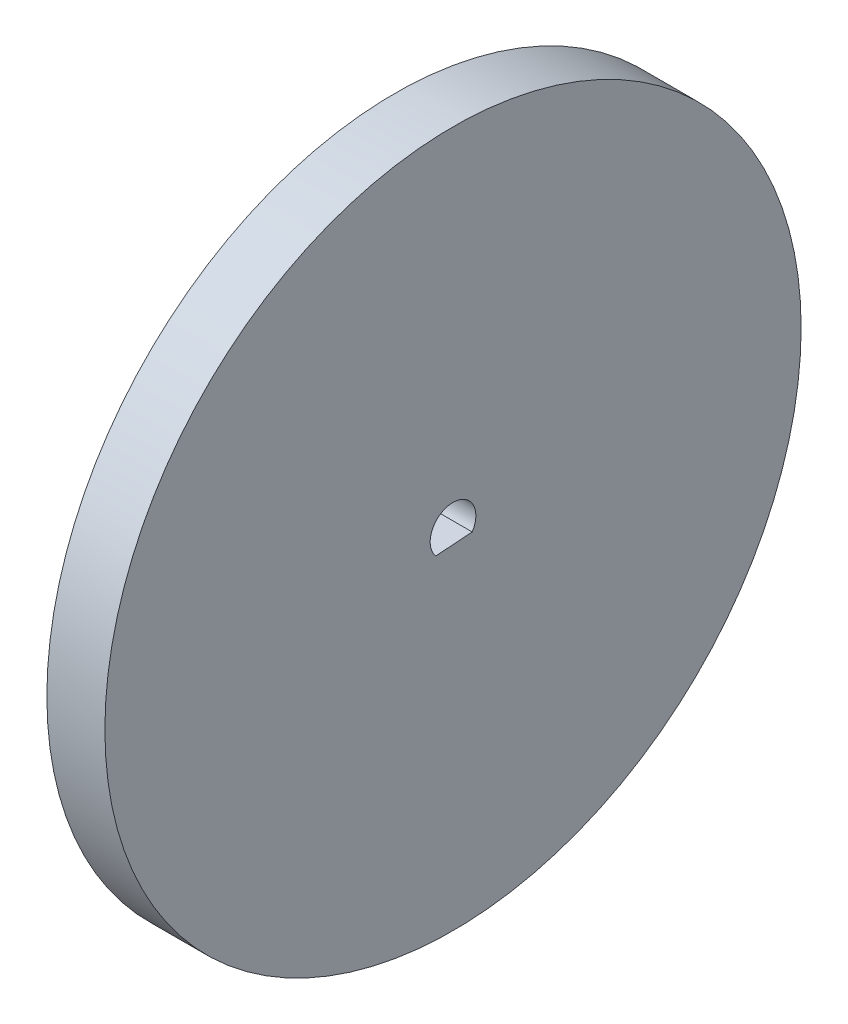
ISO-10303-21;
HEADER;
FILE_DESCRIPTION(('STEP AP214'),'2;1');
FILE_NAME('part.step','',(''),(''),'','','');
FILE_SCHEMA(('AUTOMOTIVE_DESIGN { 1 0 10303 214 1 1 1 1 }'));
ENDSEC;
DATA;
#1=APPLICATION_CONTEXT('core data for automotive mechanical design processes');
#2=APPLICATION_PROTOCOL_DEFINITION('international standard','automotive_design',2000,#1);
#3=PRODUCT_CONTEXT('',#1,'mechanical');
#4=PRODUCT('Part','Part','',(#3));
#5=PRODUCT_RELATED_PRODUCT_CATEGORY('part','',(#4));
#6=PRODUCT_DEFINITION_FORMATION('','',#4);
#7=PRODUCT_DEFINITION_CONTEXT('part definition',#1,'design');
#8=PRODUCT_DEFINITION('design','',#6,#7);
#9=PRODUCT_DEFINITION_SHAPE('','',#8);
#10=(LENGTH_UNIT() NAMED_UNIT(*) SI_UNIT(.MILLI.,.METRE.));
#11=(NAMED_UNIT(*) PLANE_ANGLE_UNIT() SI_UNIT($,.RADIAN.));
#12=(NAMED_UNIT(*) SI_UNIT($,.STERADIAN.) SOLID_ANGLE_UNIT());
#13=UNCERTAINTY_MEASURE_WITH_UNIT(LENGTH_MEASURE(1.E-05),#10,'distance_accuracy_value','');
#14=(GEOMETRIC_REPRESENTATION_CONTEXT(3) GLOBAL_UNCERTAINTY_ASSIGNED_CONTEXT((#13)) GLOBAL_UNIT_ASSIGNED_CONTEXT((#10,
#11,#12)) REPRESENTATION_CONTEXT('',''));
#15=CARTESIAN_POINT('',(0.,0.,0.));
#16=DIRECTION('',(0.,0.,1.));
#17=DIRECTION('',(1.,0.,0.));
#18=AXIS2_PLACEMENT_3D('',#15,#16,#17);
#19=CARTESIAN_POINT('',(6.35,0.,0.));
#20=DIRECTION('',(-1.,0.,0.));
#21=DIRECTION('',(0.,0.,1.));
#22=AXIS2_PLACEMENT_3D('',#19,#20,#21);
#23=CYLINDRICAL_SURFACE('',#22,38.1);
#24=CARTESIAN_POINT('',(6.35,0.,0.));
#25=DIRECTION('',(1.,0.,0.));
#26=DIRECTION('',(0.,0.,-1.));
#27=AXIS2_PLACEMENT_3D('',#24,#25,#26);
#28=CIRCLE('',#27,38.1);
#29=CARTESIAN_POINT('',(6.35,0.,-38.1));
#30=VERTEX_POINT('',#29);
#31=EDGE_CURVE('E13',#30,#30,#28,.T.);
#32=ORIENTED_EDGE('',*,*,#31,.F.);
#33=EDGE_LOOP('',(#32));
#34=FACE_BOUND('',#33,.T.);
#35=CARTESIAN_POINT('',(0.,0.,0.));
#36=DIRECTION('',(1.,0.,0.));
#37=DIRECTION('',(0.,0.,-1.));
#38=AXIS2_PLACEMENT_3D('',#35,#36,#37);
#39=CIRCLE('',#38,38.1);
#40=CARTESIAN_POINT('',(0.,0.,-38.1));
#41=VERTEX_POINT('',#40);
#42=EDGE_CURVE('E47',#41,#41,#39,.T.);
#43=ORIENTED_EDGE('',*,*,#42,.T.);
#44=EDGE_LOOP('',(#43));
#45=FACE_BOUND('',#44,.T.);
#46=ADVANCED_FACE('F44',(#34,#45),#23,.T.);
#47=CARTESIAN_POINT('',(6.35,0.,0.));
#48=DIRECTION('',(1.,0.,0.));
#49=DIRECTION('',(0.,0.,-1.));
#50=AXIS2_PLACEMENT_3D('',#47,#48,#49);
#51=PLANE('',#50);
#52=CARTESIAN_POINT('',(6.35,0.,0.));
#53=DIRECTION('',(1.,0.,0.));
#54=DIRECTION('',(0.,0.,-1.));
#55=AXIS2_PLACEMENT_3D('',#52,#53,#54);
#56=CIRCLE('',#55,2.5);
#57=CARTESIAN_POINT('',(6.35,-1.35532190021472,-2.10073857174055));
#58=VERTEX_POINT('',#57);
#59=CARTESIAN_POINT('',(6.35,-1.6372188968108,1.88931582429343));
#60=VERTEX_POINT('',#59);
#61=EDGE_CURVE('E58',#58,#60,#56,.T.);
#62=ORIENTED_EDGE('',*,*,#61,.F.);
#63=DIRECTION('',(0.,0.07047424914902,-0.997513599008496));
#64=VECTOR('',#63,1.);
#65=CARTESIAN_POINT('',(6.35,-1.6372188968108,1.88931582429343));
#66=LINE('',#65,#64);
#67=EDGE_CURVE('E77',#60,#58,#66,.T.);
#68=ORIENTED_EDGE('',*,*,#67,.F.);
#69=EDGE_LOOP('',(#62,#68));
#70=FACE_BOUND('',#69,.T.);
#71=ORIENTED_EDGE('',*,*,#31,.T.);
#72=EDGE_LOOP('',(#71));
#73=FACE_BOUND('',#72,.T.);
#74=ADVANCED_FACE('F81',(#70,#73),#51,.T.);
#75=CARTESIAN_POINT('',(0.,0.,0.));
#76=DIRECTION('',(1.,0.,0.));
#77=DIRECTION('',(0.,0.,-1.));
#78=AXIS2_PLACEMENT_3D('',#75,#76,#77);
#79=PLANE('',#78);
#80=DIRECTION('',(0.,0.07047424914902,-0.997513599008496));
#81=VECTOR('',#80,1.);
#82=CARTESIAN_POINT('',(0.,-1.6372188968108,1.88931582429343));
#83=LINE('',#82,#81);
#84=CARTESIAN_POINT('',(0.,-1.6372188968108,1.88931582429343));
#85=VERTEX_POINT('',#84);
#86=CARTESIAN_POINT('',(0.,-1.35532190021472,-2.10073857174055));
#87=VERTEX_POINT('',#86);
#88=EDGE_CURVE('E85',#85,#87,#83,.T.);
#89=ORIENTED_EDGE('',*,*,#88,.T.);
#90=CARTESIAN_POINT('',(0.,0.,0.));
#91=DIRECTION('',(1.,0.,0.));
#92=DIRECTION('',(0.,0.,-1.));
#93=AXIS2_PLACEMENT_3D('',#90,#91,#92);
#94=CIRCLE('',#93,2.5);
#95=EDGE_CURVE('E63',#87,#85,#94,.T.);
#96=ORIENTED_EDGE('',*,*,#95,.T.);
#97=EDGE_LOOP('',(#89,#96));
#98=FACE_BOUND('',#97,.T.);
#99=ORIENTED_EDGE('',*,*,#42,.F.);
#100=EDGE_LOOP('',(#99));
#101=FACE_BOUND('',#100,.T.);
#102=ADVANCED_FACE('F89',(#98,#101),#79,.F.);
#103=CARTESIAN_POINT('',(0.,0.,0.));
#104=DIRECTION('',(1.,0.,0.));
#105=DIRECTION('',(0.,0.,-1.));
#106=AXIS2_PLACEMENT_3D('',#103,#104,#105);
#107=CYLINDRICAL_SURFACE('',#106,2.5);
#108=ORIENTED_EDGE('',*,*,#61,.T.);
#109=DIRECTION('',(1.,0.,0.));
#110=VECTOR('',#109,1.);
#111=CARTESIAN_POINT('',(0.,-1.6372188968108,1.88931582429343));
#112=LINE('',#111,#110);
#113=EDGE_CURVE('E74',#85,#60,#112,.T.);
#114=ORIENTED_EDGE('',*,*,#113,.F.);
#115=ORIENTED_EDGE('',*,*,#95,.F.);
#116=DIRECTION('',(1.,0.,0.));
#117=VECTOR('',#116,1.);
#118=CARTESIAN_POINT('',(0.,-1.35532190021472,-2.10073857174055));
#119=LINE('',#118,#117);
#120=EDGE_CURVE('E68',#87,#58,#119,.T.);
#121=ORIENTED_EDGE('',*,*,#120,.T.);
#122=EDGE_LOOP('',(#108,#114,#115,#121));
#123=FACE_BOUND('',#122,.T.);
#124=ADVANCED_FACE('F70',(#123),#107,.F.);
#125=CARTESIAN_POINT('',(0.,-1.6372188968108,1.88931582429343));
#126=DIRECTION('',(0.,-0.997513599008496,-0.07047424914902));
#127=DIRECTION('',(0.,0.07047424914902,-0.997513599008496));
#128=AXIS2_PLACEMENT_3D('',#125,#126,#127);
#129=PLANE('',#128);
#130=ORIENTED_EDGE('',*,*,#67,.T.);
#131=ORIENTED_EDGE('',*,*,#120,.F.);
#132=ORIENTED_EDGE('',*,*,#88,.F.);
#133=ORIENTED_EDGE('',*,*,#113,.T.);
#134=EDGE_LOOP('',(#130,#131,#132,#133));
#135=FACE_BOUND('',#134,.T.);
#136=ADVANCED_FACE('F78',(#135),#129,.F.);
#137=CLOSED_SHELL('',(#46,#74,#102,#124,#136));
#138=MANIFOLD_SOLID_BREP('B2',#137);
#139=ADVANCED_BREP_SHAPE_REPRESENTATION('',(#18,#138),#14);
#140=SHAPE_DEFINITION_REPRESENTATION(#9,#139);
ENDSEC;
END-ISO-10303-21;
